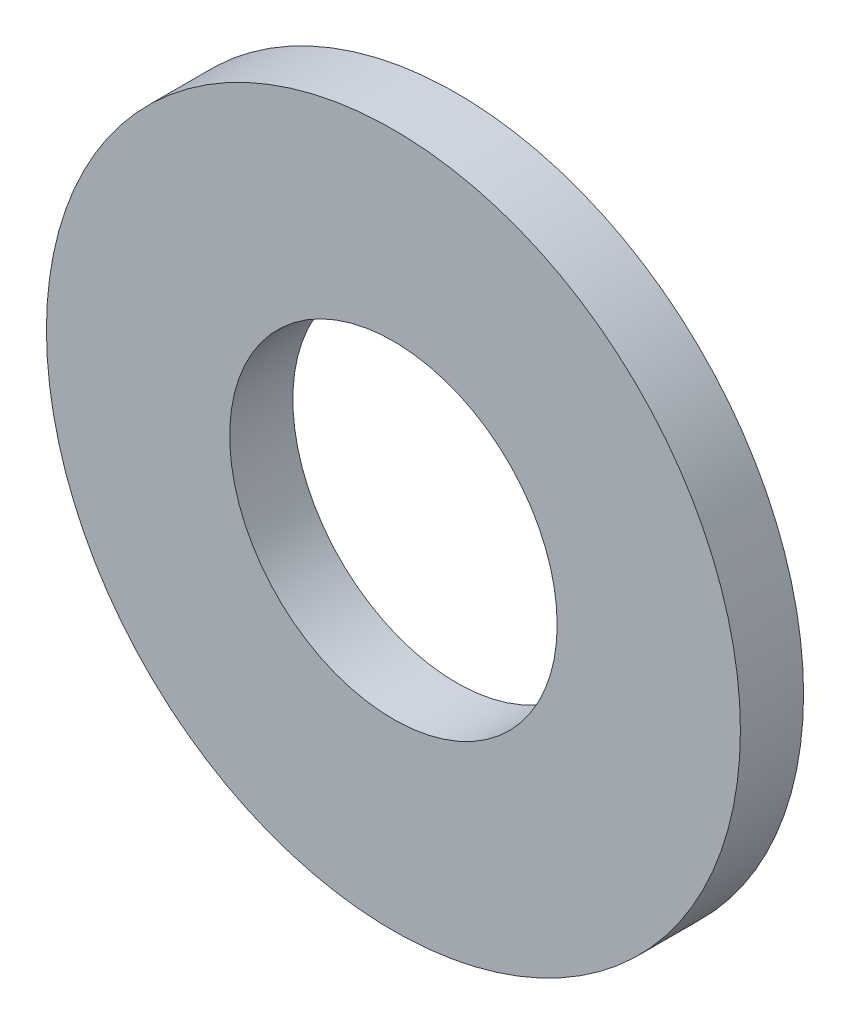
ISO-10303-21;
HEADER;
FILE_DESCRIPTION(('STEP AP214'),'2;1');
FILE_NAME('part.step','',(''),(''),'','','');
FILE_SCHEMA(('AUTOMOTIVE_DESIGN { 1 0 10303 214 1 1 1 1 }'));
ENDSEC;
DATA;
#1=APPLICATION_CONTEXT('core data for automotive mechanical design processes');
#2=APPLICATION_PROTOCOL_DEFINITION('international standard','automotive_design',2000,#1);
#3=PRODUCT_CONTEXT('',#1,'mechanical');
#4=PRODUCT('Part','Part','',(#3));
#5=PRODUCT_RELATED_PRODUCT_CATEGORY('part','',(#4));
#6=PRODUCT_DEFINITION_FORMATION('','',#4);
#7=PRODUCT_DEFINITION_CONTEXT('part definition',#1,'design');
#8=PRODUCT_DEFINITION('design','',#6,#7);
#9=PRODUCT_DEFINITION_SHAPE('','',#8);
#10=(LENGTH_UNIT() NAMED_UNIT(*) SI_UNIT(.MILLI.,.METRE.));
#11=(NAMED_UNIT(*) PLANE_ANGLE_UNIT() SI_UNIT($,.RADIAN.));
#12=(NAMED_UNIT(*) SI_UNIT($,.STERADIAN.) SOLID_ANGLE_UNIT());
#13=UNCERTAINTY_MEASURE_WITH_UNIT(LENGTH_MEASURE(1.E-05),#10,'distance_accuracy_value','');
#14=(GEOMETRIC_REPRESENTATION_CONTEXT(3) GLOBAL_UNCERTAINTY_ASSIGNED_CONTEXT((#13)) GLOBAL_UNIT_ASSIGNED_CONTEXT((#10,
#11,#12)) REPRESENTATION_CONTEXT('',''));
#15=CARTESIAN_POINT('',(0.,0.,0.));
#16=DIRECTION('',(0.,0.,1.));
#17=DIRECTION('',(1.,0.,0.));
#18=AXIS2_PLACEMENT_3D('',#15,#16,#17);
#19=CARTESIAN_POINT('',(0.,0.,0.81));
#20=DIRECTION('',(0.,0.,1.));
#21=DIRECTION('',(1.,0.,0.));
#22=AXIS2_PLACEMENT_3D('',#19,#20,#21);
#23=PLANE('',#22);
#24=CARTESIAN_POINT('',(0.,0.,0.81));
#25=DIRECTION('',(0.,0.,1.));
#26=DIRECTION('',(1.,0.,0.));
#27=AXIS2_PLACEMENT_3D('',#24,#25,#26);
#28=CIRCLE('',#27,4.45);
#29=CARTESIAN_POINT('',(4.45,0.,0.81));
#30=VERTEX_POINT('',#29);
#31=EDGE_CURVE('E10',#30,#30,#28,.T.);
#32=ORIENTED_EDGE('',*,*,#31,.T.);
#33=EDGE_LOOP('',(#32));
#34=FACE_BOUND('',#33,.T.);
#35=CARTESIAN_POINT('',(0.,0.,0.81));
#36=DIRECTION('',(0.,0.,1.));
#37=DIRECTION('',(1.,0.,0.));
#38=AXIS2_PLACEMENT_3D('',#35,#36,#37);
#39=CIRCLE('',#38,2.1);
#40=CARTESIAN_POINT('',(2.1,0.,0.81));
#41=VERTEX_POINT('',#40);
#42=EDGE_CURVE('E48',#41,#41,#39,.T.);
#43=ORIENTED_EDGE('',*,*,#42,.F.);
#44=EDGE_LOOP('',(#43));
#45=FACE_BOUND('',#44,.T.);
#46=ADVANCED_FACE('F37',(#34,#45),#23,.T.);
#47=CARTESIAN_POINT('',(0.,0.,0.));
#48=DIRECTION('',(0.,0.,1.));
#49=DIRECTION('',(1.,0.,0.));
#50=AXIS2_PLACEMENT_3D('',#47,#48,#49);
#51=PLANE('',#50);
#52=CARTESIAN_POINT('',(0.,0.,0.));
#53=DIRECTION('',(0.,0.,1.));
#54=DIRECTION('',(1.,0.,0.));
#55=AXIS2_PLACEMENT_3D('',#52,#53,#54);
#56=CIRCLE('',#55,4.45);
#57=CARTESIAN_POINT('',(4.45,0.,0.));
#58=VERTEX_POINT('',#57);
#59=EDGE_CURVE('E41',#58,#58,#56,.T.);
#60=ORIENTED_EDGE('',*,*,#59,.F.);
#61=EDGE_LOOP('',(#60));
#62=FACE_BOUND('',#61,.T.);
#63=CARTESIAN_POINT('',(0.,0.,0.));
#64=DIRECTION('',(0.,0.,1.));
#65=DIRECTION('',(1.,0.,0.));
#66=AXIS2_PLACEMENT_3D('',#63,#64,#65);
#67=CIRCLE('',#66,2.1);
#68=CARTESIAN_POINT('',(2.1,0.,0.));
#69=VERTEX_POINT('',#68);
#70=EDGE_CURVE('E50',#69,#69,#67,.T.);
#71=ORIENTED_EDGE('',*,*,#70,.T.);
#72=EDGE_LOOP('',(#71));
#73=FACE_BOUND('',#72,.T.);
#74=ADVANCED_FACE('F60',(#62,#73),#51,.F.);
#75=CARTESIAN_POINT('',(0.,0.,0.81));
#76=DIRECTION('',(0.,0.,-1.));
#77=DIRECTION('',(-1.,0.,0.));
#78=AXIS2_PLACEMENT_3D('',#75,#76,#77);
#79=CYLINDRICAL_SURFACE('',#78,4.45);
#80=ORIENTED_EDGE('',*,*,#31,.F.);
#81=EDGE_LOOP('',(#80));
#82=FACE_BOUND('',#81,.T.);
#83=ORIENTED_EDGE('',*,*,#59,.T.);
#84=EDGE_LOOP('',(#83));
#85=FACE_BOUND('',#84,.T.);
#86=ADVANCED_FACE('F39',(#82,#85),#79,.T.);
#87=CARTESIAN_POINT('',(0.,0.,0.81));
#88=DIRECTION('',(0.,0.,-1.));
#89=DIRECTION('',(-1.,0.,0.));
#90=AXIS2_PLACEMENT_3D('',#87,#88,#89);
#91=CYLINDRICAL_SURFACE('',#90,2.1);
#92=ORIENTED_EDGE('',*,*,#42,.T.);
#93=EDGE_LOOP('',(#92));
#94=FACE_BOUND('',#93,.T.);
#95=ORIENTED_EDGE('',*,*,#70,.F.);
#96=EDGE_LOOP('',(#95));
#97=FACE_BOUND('',#96,.T.);
#98=ADVANCED_FACE('F56',(#94,#97),#91,.F.);
#99=CLOSED_SHELL('',(#46,#74,#86,#98));
#100=MANIFOLD_SOLID_BREP('B2',#99);
#101=ADVANCED_BREP_SHAPE_REPRESENTATION('',(#18,#100),#14);
#102=SHAPE_DEFINITION_REPRESENTATION(#9,#101);
ENDSEC;
END-ISO-10303-21;
